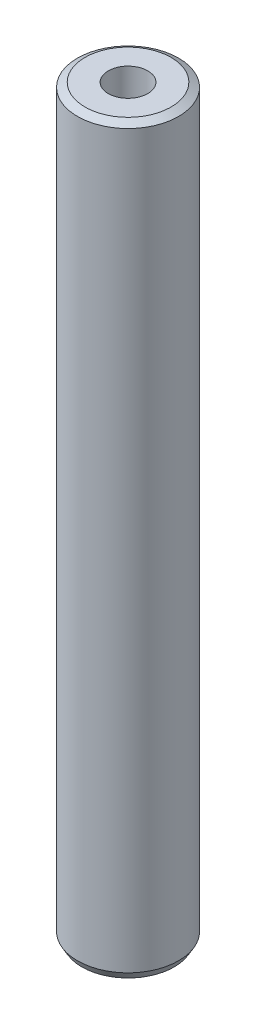
ISO-10303-21;
HEADER;
FILE_DESCRIPTION(('STEP AP214'),'2;1');
FILE_NAME('part.step','',(''),(''),'','','');
FILE_SCHEMA(('AUTOMOTIVE_DESIGN { 1 0 10303 214 1 1 1 1 }'));
ENDSEC;
DATA;
#1=APPLICATION_CONTEXT('core data for automotive mechanical design processes');
#2=APPLICATION_PROTOCOL_DEFINITION('international standard','automotive_design',2000,#1);
#3=PRODUCT_CONTEXT('',#1,'mechanical');
#4=PRODUCT('Part','Part','',(#3));
#5=PRODUCT_RELATED_PRODUCT_CATEGORY('part','',(#4));
#6=PRODUCT_DEFINITION_FORMATION('','',#4);
#7=PRODUCT_DEFINITION_CONTEXT('part definition',#1,'design');
#8=PRODUCT_DEFINITION('design','',#6,#7);
#9=PRODUCT_DEFINITION_SHAPE('','',#8);
#10=(LENGTH_UNIT() NAMED_UNIT(*) SI_UNIT(.MILLI.,.METRE.));
#11=(NAMED_UNIT(*) PLANE_ANGLE_UNIT() SI_UNIT($,.RADIAN.));
#12=(NAMED_UNIT(*) SI_UNIT($,.STERADIAN.) SOLID_ANGLE_UNIT());
#13=UNCERTAINTY_MEASURE_WITH_UNIT(LENGTH_MEASURE(1.E-05),#10,'distance_accuracy_value','');
#14=(GEOMETRIC_REPRESENTATION_CONTEXT(3) GLOBAL_UNCERTAINTY_ASSIGNED_CONTEXT((#13)) GLOBAL_UNIT_ASSIGNED_CONTEXT((#10,
#11,#12)) REPRESENTATION_CONTEXT('',''));
#15=CARTESIAN_POINT('',(0.,0.,0.));
#16=DIRECTION('',(0.,0.,1.));
#17=DIRECTION('',(1.,0.,0.));
#18=AXIS2_PLACEMENT_3D('',#15,#16,#17);
#19=CARTESIAN_POINT('',(0.,550.928941751781,0.));
#20=DIRECTION('',(0.,-1.,0.));
#21=DIRECTION('',(0.,0.,-1.));
#22=AXIS2_PLACEMENT_3D('',#19,#20,#21);
#23=CYLINDRICAL_SURFACE('',#22,37.5);
#24=CARTESIAN_POINT('',(0.,547.692731317247,0.));
#25=DIRECTION('',(0.,1.,0.));
#26=DIRECTION('',(0.,0.,1.));
#27=AXIS2_PLACEMENT_3D('',#24,#25,#26);
#28=CIRCLE('',#27,37.5);
#29=CARTESIAN_POINT('',(0.,547.692731317247,-37.5000000000001));
#30=VERTEX_POINT('',#29);
#31=EDGE_CURVE('E50',#30,#30,#28,.F.);
#32=ORIENTED_EDGE('',*,*,#31,.T.);
#33=EDGE_LOOP('',(#32));
#34=FACE_BOUND('',#33,.T.);
#35=CARTESIAN_POINT('',(0.,5.6052808965964,0.));
#36=DIRECTION('',(0.,1.,0.));
#37=DIRECTION('',(0.,0.,1.));
#38=AXIS2_PLACEMENT_3D('',#35,#36,#37);
#39=CIRCLE('',#38,37.5);
#40=CARTESIAN_POINT('',(0.,5.6052808965964,37.5));
#41=VERTEX_POINT('',#40);
#42=EDGE_CURVE('E51',#41,#41,#39,.T.);
#43=ORIENTED_EDGE('',*,*,#42,.T.);
#44=EDGE_LOOP('',(#43));
#45=FACE_BOUND('',#44,.T.);
#46=ADVANCED_FACE('F39',(#34,#45),#23,.T.);
#47=CARTESIAN_POINT('',(0.,550.928941751781,0.));
#48=DIRECTION('',(0.,1.,0.));
#49=DIRECTION('',(0.,0.,1.));
#50=AXIS2_PLACEMENT_3D('',#47,#48,#49);
#51=PLANE('',#50);
#52=CARTESIAN_POINT('',(0.,550.928941751781,0.));
#53=DIRECTION('',(0.,1.,0.));
#54=DIRECTION('',(0.,0.,1.));
#55=AXIS2_PLACEMENT_3D('',#52,#53,#54);
#56=CIRCLE('',#55,31.8947191034035);
#57=CARTESIAN_POINT('',(0.,550.928941751781,-31.8947191034036));
#58=VERTEX_POINT('',#57);
#59=EDGE_CURVE('E54',#58,#58,#56,.T.);
#60=ORIENTED_EDGE('',*,*,#59,.T.);
#61=EDGE_LOOP('',(#60));
#62=FACE_BOUND('',#61,.T.);
#63=CARTESIAN_POINT('',(0.,550.928941751781,0.));
#64=DIRECTION('',(0.,1.,0.));
#65=DIRECTION('',(0.,0.,1.));
#66=AXIS2_PLACEMENT_3D('',#63,#64,#65);
#67=CIRCLE('',#66,14.6397863213055);
#68=CARTESIAN_POINT('',(0.,550.928941751781,14.6397863213055));
#69=VERTEX_POINT('',#68);
#70=EDGE_CURVE('E58',#69,#69,#67,.T.);
#71=ORIENTED_EDGE('',*,*,#70,.F.);
#72=EDGE_LOOP('',(#71));
#73=FACE_BOUND('',#72,.T.);
#74=ADVANCED_FACE('F69',(#62,#73),#51,.T.);
#75=CARTESIAN_POINT('',(0.,0.,0.));
#76=DIRECTION('',(0.,1.,0.));
#77=DIRECTION('',(0.,0.,1.));
#78=AXIS2_PLACEMENT_3D('',#75,#76,#77);
#79=PLANE('',#78);
#80=CARTESIAN_POINT('',(0.,0.,0.));
#81=DIRECTION('',(0.,1.,0.));
#82=DIRECTION('',(0.,0.,1.));
#83=AXIS2_PLACEMENT_3D('',#80,#81,#82);
#84=CIRCLE('',#83,34.2637895654666);
#85=CARTESIAN_POINT('',(0.,0.,34.2637895654666));
#86=VERTEX_POINT('',#85);
#87=EDGE_CURVE('E10',#86,#86,#84,.F.);
#88=ORIENTED_EDGE('',*,*,#87,.T.);
#89=EDGE_LOOP('',(#88));
#90=FACE_BOUND('',#89,.T.);
#91=CARTESIAN_POINT('',(0.,0.,0.));
#92=DIRECTION('',(0.,1.,0.));
#93=DIRECTION('',(0.,0.,1.));
#94=AXIS2_PLACEMENT_3D('',#91,#92,#93);
#95=CIRCLE('',#94,14.6397863213055);
#96=CARTESIAN_POINT('',(0.,0.,14.6397863213055));
#97=VERTEX_POINT('',#96);
#98=EDGE_CURVE('E63',#97,#97,#95,.T.);
#99=ORIENTED_EDGE('',*,*,#98,.T.);
#100=EDGE_LOOP('',(#99));
#101=FACE_BOUND('',#100,.T.);
#102=ADVANCED_FACE('F75',(#90,#101),#79,.F.);
#103=CARTESIAN_POINT('',(0.,550.928941751781,0.));
#104=DIRECTION('',(0.,-1.,0.));
#105=DIRECTION('',(0.,0.,-1.));
#106=AXIS2_PLACEMENT_3D('',#103,#104,#105);
#107=CYLINDRICAL_SURFACE('',#106,14.6397863213055);
#108=ORIENTED_EDGE('',*,*,#70,.T.);
#109=EDGE_LOOP('',(#108));
#110=FACE_BOUND('',#109,.T.);
#111=ORIENTED_EDGE('',*,*,#98,.F.);
#112=EDGE_LOOP('',(#111));
#113=FACE_BOUND('',#112,.T.);
#114=ADVANCED_FACE('F70',(#110,#113),#107,.F.);
#115=CARTESIAN_POINT('',(0.,550.928941751781,0.));
#116=DIRECTION('',(0.,-1.,0.));
#117=DIRECTION('',(0.,0.,-1.));
#118=AXIS2_PLACEMENT_3D('',#115,#116,#117);
#119=CONICAL_SURFACE('',#118,31.8947191034035,1.04719755119658);
#120=CARTESIAN_POINT('',(0.,547.692731317247,-37.5000000000001));
#121=CARTESIAN_POINT('',(0.,547.726441842607,-37.4416116573272));
#122=CARTESIAN_POINT('',(0.,547.760152367967,-37.3832233146543));
#123=CARTESIAN_POINT('',(0.,547.827573418686,-37.2664466293086));
#124=CARTESIAN_POINT('',(0.,547.861283944046,-37.2080582866357));
#125=CARTESIAN_POINT('',(0.,547.928704994765,-37.0912816012899));
#126=CARTESIAN_POINT('',(0.,547.962415520125,-37.0328932586171));
#127=CARTESIAN_POINT('',(0.,548.029836570845,-36.9161165732713));
#128=CARTESIAN_POINT('',(0.,548.063547096204,-36.8577282305984));
#129=CARTESIAN_POINT('',(0.,548.130968146924,-36.7409515452527));
#130=CARTESIAN_POINT('',(0.,548.164678672283,-36.6825632025798));
#131=CARTESIAN_POINT('',(0.,548.232099723003,-36.565786517234));
#132=CARTESIAN_POINT('',(0.,548.265810248363,-36.5073981745611));
#133=CARTESIAN_POINT('',(0.,548.333231299082,-36.3906214892154));
#134=CARTESIAN_POINT('',(0.,548.366941824442,-36.3322331465425));
#135=CARTESIAN_POINT('',(0.,548.434362875161,-36.2154564611967));
#136=CARTESIAN_POINT('',(0.,548.468073400521,-36.1570681185239));
#137=CARTESIAN_POINT('',(0.,548.535494451241,-36.0402914331781));
#138=CARTESIAN_POINT('',(0.,548.5692049766,-35.9819030905052));
#139=CARTESIAN_POINT('',(0.,548.63662602732,-35.8651264051595));
#140=CARTESIAN_POINT('',(0.,548.670336552679,-35.8067380624866));
#141=CARTESIAN_POINT('',(0.,548.737757603399,-35.6899613771408));
#142=CARTESIAN_POINT('',(0.,548.771468128759,-35.6315730344679));
#143=CARTESIAN_POINT('',(0.,548.838889179478,-35.5147963491222));
#144=CARTESIAN_POINT('',(0.,548.872599704838,-35.4564080064493));
#145=CARTESIAN_POINT('',(0.,548.940020755557,-35.3396313211035));
#146=CARTESIAN_POINT('',(0.,548.973731280917,-35.2812429784307));
#147=CARTESIAN_POINT('',(0.,549.041152331636,-35.1644662930849));
#148=CARTESIAN_POINT('',(0.,549.074862856996,-35.106077950412));
#149=CARTESIAN_POINT('',(0.,549.142283907716,-34.9893012650663));
#150=CARTESIAN_POINT('',(0.,549.175994433075,-34.9309129223934));
#151=CARTESIAN_POINT('',(0.,549.243415483795,-34.8141362370476));
#152=CARTESIAN_POINT('',(0.,549.277126009154,-34.7557478943747));
#153=CARTESIAN_POINT('',(0.,549.344547059874,-34.638971209029));
#154=CARTESIAN_POINT('',(0.,549.378257585234,-34.5805828663561));
#155=CARTESIAN_POINT('',(0.,549.445678635953,-34.4638061810103));
#156=CARTESIAN_POINT('',(0.,549.479389161313,-34.4054178383375));
#157=CARTESIAN_POINT('',(0.,549.546810212032,-34.2886411529917));
#158=CARTESIAN_POINT('',(0.,549.580520737392,-34.2302528103188));
#159=CARTESIAN_POINT('',(0.,549.647941788111,-34.1134761249731));
#160=CARTESIAN_POINT('',(0.,549.681652313471,-34.0550877823002));
#161=CARTESIAN_POINT('',(0.,549.749073364191,-33.9383110969544));
#162=CARTESIAN_POINT('',(0.,549.78278388955,-33.8799227542815));
#163=CARTESIAN_POINT('',(0.,549.85020494027,-33.7631460689358));
#164=CARTESIAN_POINT('',(0.,549.883915465629,-33.7047577262629));
#165=CARTESIAN_POINT('',(0.,549.951336516349,-33.5879810409171));
#166=CARTESIAN_POINT('',(0.,549.985047041709,-33.5295926982443));
#167=CARTESIAN_POINT('',(0.,550.052468092428,-33.4128160128985));
#168=CARTESIAN_POINT('',(0.,550.086178617788,-33.3544276702256));
#169=CARTESIAN_POINT('',(0.,550.153599668507,-33.2376509848799));
#170=CARTESIAN_POINT('',(0.,550.187310193867,-33.179262642207));
#171=CARTESIAN_POINT('',(0.,550.254731244586,-33.0624859568612));
#172=CARTESIAN_POINT('',(0.,550.288441769946,-33.0040976141883));
#173=CARTESIAN_POINT('',(0.,550.355862820666,-32.8873209288426));
#174=CARTESIAN_POINT('',(0.,550.389573346025,-32.8289325861697));
#175=CARTESIAN_POINT('',(0.,550.456994396745,-32.7121559008239));
#176=CARTESIAN_POINT('',(0.,550.490704922105,-32.6537675581511));
#177=CARTESIAN_POINT('',(0.,550.558125972824,-32.5369908728053));
#178=CARTESIAN_POINT('',(0.,550.591836498184,-32.4786025301324));
#179=CARTESIAN_POINT('',(0.,550.659257548903,-32.3618258447867));
#180=CARTESIAN_POINT('',(0.,550.692968074263,-32.3034375021138));
#181=CARTESIAN_POINT('',(0.,550.760389124982,-32.186660816768));
#182=CARTESIAN_POINT('',(0.,550.794099650342,-32.1282724740951));
#183=CARTESIAN_POINT('',(0.,550.861520701061,-32.0114957887494));
#184=CARTESIAN_POINT('',(0.,550.895231226421,-31.9531074460765));
#185=CARTESIAN_POINT('',(0.,550.928941751781,-31.8947191034036));
#186=B_SPLINE_CURVE_WITH_KNOTS('',3,(#120,#121,#122,#123,#124,#125,#126,#127,#128,#129,#130,
#131,#132,#133,#134,#135,#136,#137,#138,#139,#140,#141,#142,#143,#144,#145,#146,#147,#148,#149,
#150,#151,#152,#153,#154,#155,#156,#157,#158,#159,#160,#161,#162,#163,#164,#165,#166,#167,#168,
#169,#170,#171,#172,#173,#174,#175,#176,#177,#178,#179,#180,#181,#182,#183,#184,#185),
.UNSPECIFIED.,.F.,.F.,(4,2,2,2,2,2,2,2,2,2,2,2,2,2,2,2,2,2,2,2,2,2,2,2,2,2,2,2,2,2,2,2,4),(0.,
0.202263152158336,0.404526304316673,0.606789456475009,0.809052608633346,1.01131576079168,
1.21357891295001,1.41584206510835,1.61810521726674,1.82036836942508,2.02263152158341,
2.22489467374175,2.42715782590009,2.62942097805842,2.83168413021675,3.03394728237509,
3.23621043453348,3.43847358669182,3.64073673885016,3.84299989100849,4.04526304316683,
4.24752619532517,4.4497893474835,4.65205249964183,4.85431565180022,5.05657880395856,
5.2588419561169,5.46110510827523,5.66336826043357,5.86563141259191,6.06789456475024,
6.27015771690857,6.47242086906697),.UNSPECIFIED.);
#187=EDGE_CURVE('BSEAM81',#30,#58,#186,.T.);
#188=ORIENTED_EDGE('',*,*,#31,.F.);
#189=ORIENTED_EDGE('',*,*,#59,.F.);
#190=ORIENTED_EDGE('',*,*,#187,.T.);
#191=ORIENTED_EDGE('',*,*,#187,.F.);
#192=EDGE_LOOP('',(#188,#190,#189,#191));
#193=FACE_BOUND('',#192,.T.);
#194=ADVANCED_FACE('F81',(#193),#119,.T.);
#195=CARTESIAN_POINT('',(0.,5.6052808965964,0.));
#196=DIRECTION('',(0.,1.,0.));
#197=DIRECTION('',(0.,0.,1.));
#198=AXIS2_PLACEMENT_3D('',#195,#196,#197);
#199=CONICAL_SURFACE('',#198,37.5,0.523598775598303);
#200=ORIENTED_EDGE('',*,*,#87,.F.);
#201=EDGE_LOOP('',(#200));
#202=FACE_BOUND('',#201,.T.);
#203=ORIENTED_EDGE('',*,*,#42,.F.);
#204=EDGE_LOOP('',(#203));
#205=FACE_BOUND('',#204,.T.);
#206=ADVANCED_FACE('F45',(#202,#205),#199,.T.);
#207=CLOSED_SHELL('',(#46,#74,#102,#114,#194,#206));
#208=MANIFOLD_SOLID_BREP('B2',#207);
#209=ADVANCED_BREP_SHAPE_REPRESENTATION('',(#18,#208),#14);
#210=SHAPE_DEFINITION_REPRESENTATION(#9,#209);
ENDSEC;
END-ISO-10303-21;
